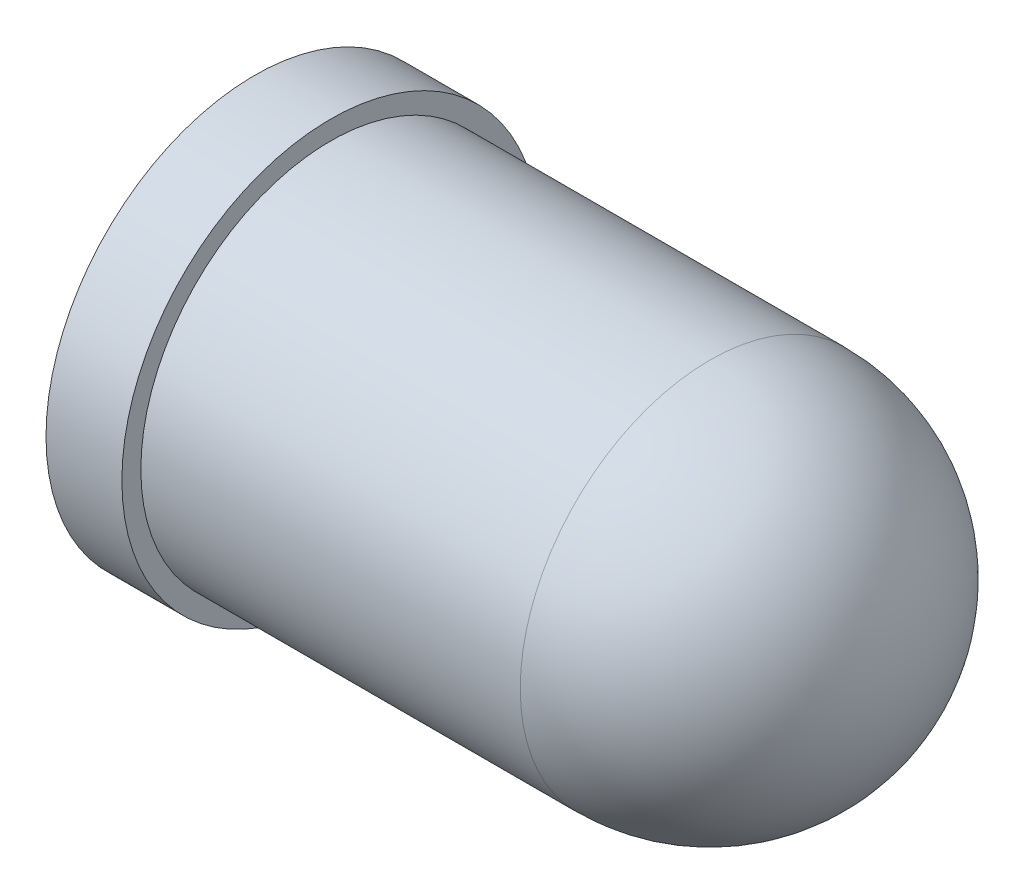
ISO-10303-21;
HEADER;
FILE_DESCRIPTION(('STEP AP214'),'2;1');
FILE_NAME('part.step','',(''),(''),'','','');
FILE_SCHEMA(('AUTOMOTIVE_DESIGN { 1 0 10303 214 1 1 1 1 }'));
ENDSEC;
DATA;
#1=APPLICATION_CONTEXT('core data for automotive mechanical design processes');
#2=APPLICATION_PROTOCOL_DEFINITION('international standard','automotive_design',2000,#1);
#3=PRODUCT_CONTEXT('',#1,'mechanical');
#4=PRODUCT('Part','Part','',(#3));
#5=PRODUCT_RELATED_PRODUCT_CATEGORY('part','',(#4));
#6=PRODUCT_DEFINITION_FORMATION('','',#4);
#7=PRODUCT_DEFINITION_CONTEXT('part definition',#1,'design');
#8=PRODUCT_DEFINITION('design','',#6,#7);
#9=PRODUCT_DEFINITION_SHAPE('','',#8);
#10=(LENGTH_UNIT() NAMED_UNIT(*) SI_UNIT(.MILLI.,.METRE.));
#11=(NAMED_UNIT(*) PLANE_ANGLE_UNIT() SI_UNIT($,.RADIAN.));
#12=(NAMED_UNIT(*) SI_UNIT($,.STERADIAN.) SOLID_ANGLE_UNIT());
#13=UNCERTAINTY_MEASURE_WITH_UNIT(LENGTH_MEASURE(1.E-05),#10,'distance_accuracy_value','');
#14=(GEOMETRIC_REPRESENTATION_CONTEXT(3) GLOBAL_UNCERTAINTY_ASSIGNED_CONTEXT((#13)) GLOBAL_UNIT_ASSIGNED_CONTEXT((#10,
#11,#12)) REPRESENTATION_CONTEXT('',''));
#15=CARTESIAN_POINT('',(0.,0.,0.));
#16=DIRECTION('',(0.,0.,1.));
#17=DIRECTION('',(1.,0.,0.));
#18=AXIS2_PLACEMENT_3D('',#15,#16,#17);
#19=CARTESIAN_POINT('',(0.,0.,0.));
#20=DIRECTION('',(-1.,0.,0.));
#21=DIRECTION('',(0.,1.,0.));
#22=AXIS2_PLACEMENT_3D('',#19,#20,#21);
#23=SPHERICAL_SURFACE('',#22,2.5);
#24=CARTESIAN_POINT('',(0.,0.,0.));
#25=DIRECTION('',(-1.,0.,0.));
#26=DIRECTION('',(0.,0.,1.));
#27=AXIS2_PLACEMENT_3D('',#24,#25,#26);
#28=CIRCLE('',#27,2.5);
#29=CARTESIAN_POINT('',(0.,0.,2.5));
#30=VERTEX_POINT('',#29);
#31=EDGE_CURVE('E10',#30,#30,#28,.T.);
#32=ORIENTED_EDGE('',*,*,#31,.F.);
#33=EDGE_LOOP('',(#32));
#34=FACE_BOUND('',#33,.T.);
#35=ADVANCED_FACE('F31',(#34),#23,.T.);
#36=CARTESIAN_POINT('',(-5.99999999999999,0.,0.));
#37=DIRECTION('',(-1.,0.,0.));
#38=DIRECTION('',(0.,0.,1.));
#39=AXIS2_PLACEMENT_3D('',#36,#37,#38);
#40=CYLINDRICAL_SURFACE('',#39,2.5);
#41=CARTESIAN_POINT('',(-5.,0.,0.));
#42=DIRECTION('',(-1.,0.,0.));
#43=DIRECTION('',(0.,0.,1.));
#44=AXIS2_PLACEMENT_3D('',#41,#42,#43);
#45=CIRCLE('',#44,2.5);
#46=CARTESIAN_POINT('',(-5.,0.,2.5));
#47=VERTEX_POINT('',#46);
#48=EDGE_CURVE('E37',#47,#47,#45,.T.);
#49=ORIENTED_EDGE('',*,*,#48,.F.);
#50=EDGE_LOOP('',(#49));
#51=FACE_BOUND('',#50,.T.);
#52=ORIENTED_EDGE('',*,*,#31,.T.);
#53=EDGE_LOOP('',(#52));
#54=FACE_BOUND('',#53,.T.);
#55=ADVANCED_FACE('F61',(#51,#54),#40,.T.);
#56=CARTESIAN_POINT('',(-5.,2.5,0.));
#57=DIRECTION('',(-1.,0.,0.));
#58=DIRECTION('',(0.,0.,1.));
#59=AXIS2_PLACEMENT_3D('',#56,#57,#58);
#60=PLANE('',#59);
#61=CARTESIAN_POINT('',(-5.,0.,0.));
#62=DIRECTION('',(-1.,0.,0.));
#63=DIRECTION('',(0.,0.,1.));
#64=AXIS2_PLACEMENT_3D('',#61,#62,#63);
#65=CIRCLE('',#64,2.75);
#66=CARTESIAN_POINT('',(-5.,0.,2.75));
#67=VERTEX_POINT('',#66);
#68=EDGE_CURVE('E41',#67,#67,#65,.T.);
#69=ORIENTED_EDGE('',*,*,#68,.F.);
#70=EDGE_LOOP('',(#69));
#71=FACE_BOUND('',#70,.T.);
#72=ORIENTED_EDGE('',*,*,#48,.T.);
#73=EDGE_LOOP('',(#72));
#74=FACE_BOUND('',#73,.T.);
#75=ADVANCED_FACE('F56',(#71,#74),#60,.F.);
#76=CARTESIAN_POINT('',(-5.99999999999999,0.,0.));
#77=DIRECTION('',(-1.,0.,0.));
#78=DIRECTION('',(0.,0.,1.));
#79=AXIS2_PLACEMENT_3D('',#76,#77,#78);
#80=CYLINDRICAL_SURFACE('',#79,2.75);
#81=CARTESIAN_POINT('',(-5.99999999999999,0.,0.));
#82=DIRECTION('',(-1.,0.,0.));
#83=DIRECTION('',(0.,0.,1.));
#84=AXIS2_PLACEMENT_3D('',#81,#82,#83);
#85=CIRCLE('',#84,2.75);
#86=CARTESIAN_POINT('',(-5.99999999999999,0.,2.75));
#87=VERTEX_POINT('',#86);
#88=EDGE_CURVE('E45',#87,#87,#85,.T.);
#89=ORIENTED_EDGE('',*,*,#88,.F.);
#90=EDGE_LOOP('',(#89));
#91=FACE_BOUND('',#90,.T.);
#92=ORIENTED_EDGE('',*,*,#68,.T.);
#93=EDGE_LOOP('',(#92));
#94=FACE_BOUND('',#93,.T.);
#95=ADVANCED_FACE('F53',(#91,#94),#80,.T.);
#96=CARTESIAN_POINT('',(-5.99999999999999,2.75,0.));
#97=DIRECTION('',(1.,0.,0.));
#98=DIRECTION('',(0.,0.,-1.));
#99=AXIS2_PLACEMENT_3D('',#96,#97,#98);
#100=PLANE('',#99);
#101=ORIENTED_EDGE('',*,*,#88,.T.);
#102=EDGE_LOOP('',(#101));
#103=FACE_BOUND('',#102,.T.);
#104=ADVANCED_FACE('F51',(#103),#100,.F.);
#105=CLOSED_SHELL('',(#35,#55,#75,#95,#104));
#106=MANIFOLD_SOLID_BREP('B2',#105);
#107=ADVANCED_BREP_SHAPE_REPRESENTATION('',(#18,#106),#14);
#108=SHAPE_DEFINITION_REPRESENTATION(#9,#107);
ENDSEC;
END-ISO-10303-21;
